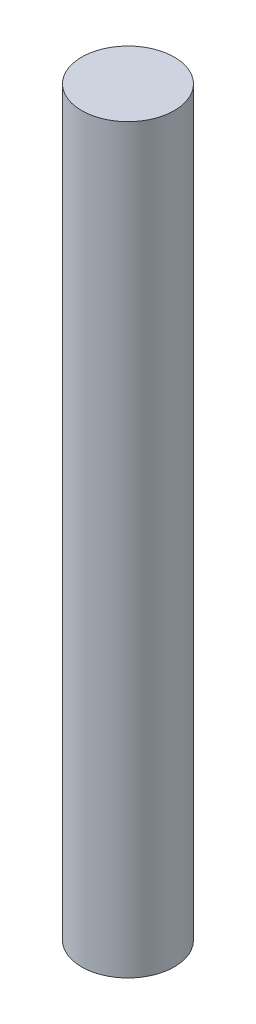
ISO-10303-21;
HEADER;
FILE_DESCRIPTION(('STEP AP214'),'2;1');
FILE_NAME('part.step','',(''),(''),'','','');
FILE_SCHEMA(('AUTOMOTIVE_DESIGN { 1 0 10303 214 1 1 1 1 }'));
ENDSEC;
DATA;
#1=APPLICATION_CONTEXT('core data for automotive mechanical design processes');
#2=APPLICATION_PROTOCOL_DEFINITION('international standard','automotive_design',2000,#1);
#3=PRODUCT_CONTEXT('',#1,'mechanical');
#4=PRODUCT('Part','Part','',(#3));
#5=PRODUCT_RELATED_PRODUCT_CATEGORY('part','',(#4));
#6=PRODUCT_DEFINITION_FORMATION('','',#4);
#7=PRODUCT_DEFINITION_CONTEXT('part definition',#1,'design');
#8=PRODUCT_DEFINITION('design','',#6,#7);
#9=PRODUCT_DEFINITION_SHAPE('','',#8);
#10=(LENGTH_UNIT() NAMED_UNIT(*) SI_UNIT(.MILLI.,.METRE.));
#11=(NAMED_UNIT(*) PLANE_ANGLE_UNIT() SI_UNIT($,.RADIAN.));
#12=(NAMED_UNIT(*) SI_UNIT($,.STERADIAN.) SOLID_ANGLE_UNIT());
#13=UNCERTAINTY_MEASURE_WITH_UNIT(LENGTH_MEASURE(1.E-05),#10,'distance_accuracy_value','');
#14=(GEOMETRIC_REPRESENTATION_CONTEXT(3) GLOBAL_UNCERTAINTY_ASSIGNED_CONTEXT((#13)) GLOBAL_UNIT_ASSIGNED_CONTEXT((#10,
#11,#12)) REPRESENTATION_CONTEXT('',''));
#15=CARTESIAN_POINT('',(0.,0.,0.));
#16=DIRECTION('',(0.,0.,1.));
#17=DIRECTION('',(1.,0.,0.));
#18=AXIS2_PLACEMENT_3D('',#15,#16,#17);
#19=CARTESIAN_POINT('',(0.,20.,0.));
#20=DIRECTION('',(0.,-1.,0.));
#21=DIRECTION('',(0.,0.,-1.));
#22=AXIS2_PLACEMENT_3D('',#19,#20,#21);
#23=CYLINDRICAL_SURFACE('',#22,2.5);
#24=CARTESIAN_POINT('',(0.,20.,0.));
#25=DIRECTION('',(0.,1.,0.));
#26=DIRECTION('',(0.,0.,1.));
#27=AXIS2_PLACEMENT_3D('',#24,#25,#26);
#28=CIRCLE('',#27,2.5);
#29=CARTESIAN_POINT('',(0.,20.,2.5));
#30=VERTEX_POINT('',#29);
#31=EDGE_CURVE('E10',#30,#30,#28,.T.);
#32=ORIENTED_EDGE('',*,*,#31,.F.);
#33=EDGE_LOOP('',(#32));
#34=FACE_BOUND('',#33,.T.);
#35=CARTESIAN_POINT('',(0.,-20.,0.));
#36=DIRECTION('',(0.,1.,0.));
#37=DIRECTION('',(0.,0.,1.));
#38=AXIS2_PLACEMENT_3D('',#35,#36,#37);
#39=CIRCLE('',#38,2.5);
#40=CARTESIAN_POINT('',(0.,-20.,2.5));
#41=VERTEX_POINT('',#40);
#42=EDGE_CURVE('E35',#41,#41,#39,.T.);
#43=ORIENTED_EDGE('',*,*,#42,.T.);
#44=EDGE_LOOP('',(#43));
#45=FACE_BOUND('',#44,.T.);
#46=ADVANCED_FACE('F32',(#34,#45),#23,.T.);
#47=CARTESIAN_POINT('',(0.,20.,0.));
#48=DIRECTION('',(0.,1.,0.));
#49=DIRECTION('',(0.,0.,1.));
#50=AXIS2_PLACEMENT_3D('',#47,#48,#49);
#51=PLANE('',#50);
#52=ORIENTED_EDGE('',*,*,#31,.T.);
#53=EDGE_LOOP('',(#52));
#54=FACE_BOUND('',#53,.T.);
#55=ADVANCED_FACE('F47',(#54),#51,.T.);
#56=CARTESIAN_POINT('',(0.,-20.,0.));
#57=DIRECTION('',(0.,1.,0.));
#58=DIRECTION('',(0.,0.,1.));
#59=AXIS2_PLACEMENT_3D('',#56,#57,#58);
#60=PLANE('',#59);
#61=ORIENTED_EDGE('',*,*,#42,.F.);
#62=EDGE_LOOP('',(#61));
#63=FACE_BOUND('',#62,.T.);
#64=ADVANCED_FACE('F45',(#63),#60,.F.);
#65=CLOSED_SHELL('',(#46,#55,#64));
#66=MANIFOLD_SOLID_BREP('B2',#65);
#67=ADVANCED_BREP_SHAPE_REPRESENTATION('',(#18,#66),#14);
#68=SHAPE_DEFINITION_REPRESENTATION(#9,#67);
ENDSEC;
END-ISO-10303-21;
